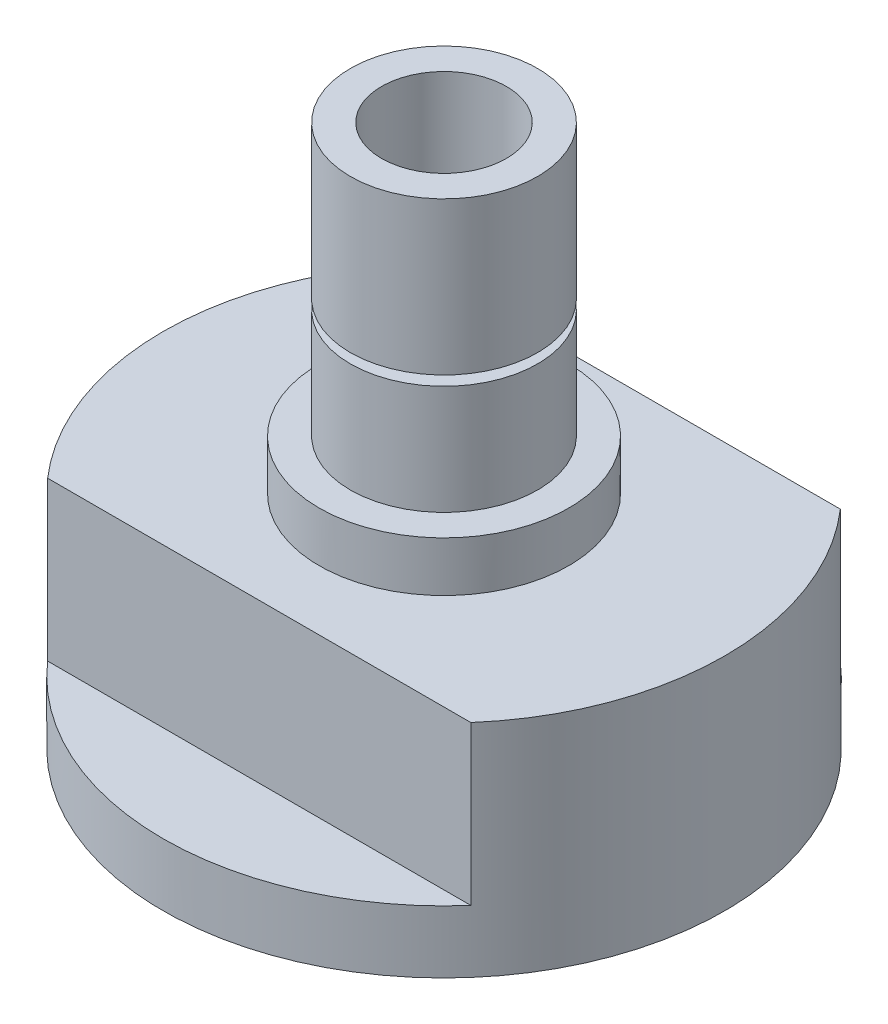
ISO-10303-21;
HEADER;
FILE_DESCRIPTION(('STEP AP214'),'2;1');
FILE_NAME('part.step','',(''),(''),'','','');
FILE_SCHEMA(('AUTOMOTIVE_DESIGN { 1 0 10303 214 1 1 1 1 }'));
ENDSEC;
DATA;
#1=APPLICATION_CONTEXT('core data for automotive mechanical design processes');
#2=APPLICATION_PROTOCOL_DEFINITION('international standard','automotive_design',2000,#1);
#3=PRODUCT_CONTEXT('',#1,'mechanical');
#4=PRODUCT('Part','Part','',(#3));
#5=PRODUCT_RELATED_PRODUCT_CATEGORY('part','',(#4));
#6=PRODUCT_DEFINITION_FORMATION('','',#4);
#7=PRODUCT_DEFINITION_CONTEXT('part definition',#1,'design');
#8=PRODUCT_DEFINITION('design','',#6,#7);
#9=PRODUCT_DEFINITION_SHAPE('','',#8);
#10=(LENGTH_UNIT() NAMED_UNIT(*) SI_UNIT(.MILLI.,.METRE.));
#11=(NAMED_UNIT(*) PLANE_ANGLE_UNIT() SI_UNIT($,.RADIAN.));
#12=(NAMED_UNIT(*) SI_UNIT($,.STERADIAN.) SOLID_ANGLE_UNIT());
#13=UNCERTAINTY_MEASURE_WITH_UNIT(LENGTH_MEASURE(1.E-05),#10,'distance_accuracy_value','');
#14=(GEOMETRIC_REPRESENTATION_CONTEXT(3) GLOBAL_UNCERTAINTY_ASSIGNED_CONTEXT((#13)) GLOBAL_UNIT_ASSIGNED_CONTEXT((#10,
#11,#12)) REPRESENTATION_CONTEXT('',''));
#15=CARTESIAN_POINT('',(0.,0.,0.));
#16=DIRECTION('',(0.,0.,1.));
#17=DIRECTION('',(1.,0.,0.));
#18=AXIS2_PLACEMENT_3D('',#15,#16,#17);
#19=CARTESIAN_POINT('',(0.,32.7025,0.));
#20=DIRECTION('',(0.,-1.,0.));
#21=DIRECTION('',(0.,0.,-1.));
#22=AXIS2_PLACEMENT_3D('',#19,#20,#21);
#23=CYLINDRICAL_SURFACE('',#22,9.525);
#24=CARTESIAN_POINT('',(0.,5.08,0.));
#25=DIRECTION('',(0.,1.,0.));
#26=DIRECTION('',(0.,0.,1.));
#27=AXIS2_PLACEMENT_3D('',#24,#25,#26);
#28=CIRCLE('',#27,9.525);
#29=CARTESIAN_POINT('',(0.,5.08,9.525));
#30=VERTEX_POINT('',#29);
#31=EDGE_CURVE('E119',#30,#30,#28,.T.);
#32=ORIENTED_EDGE('',*,*,#31,.T.);
#33=EDGE_LOOP('',(#32));
#34=FACE_BOUND('',#33,.T.);
#35=CARTESIAN_POINT('',(0.,16.1925,0.));
#36=DIRECTION('',(0.,1.,0.));
#37=DIRECTION('',(0.,0.,1.));
#38=AXIS2_PLACEMENT_3D('',#35,#36,#37);
#39=CIRCLE('',#38,9.525);
#40=CARTESIAN_POINT('',(0.,16.1925,9.525));
#41=VERTEX_POINT('',#40);
#42=EDGE_CURVE('E109',#41,#41,#39,.T.);
#43=ORIENTED_EDGE('',*,*,#42,.F.);
#44=EDGE_LOOP('',(#43));
#45=FACE_BOUND('',#44,.T.);
#46=ADVANCED_FACE('F40',(#34,#45),#23,.T.);
#47=CARTESIAN_POINT('',(0.,5.08,0.));
#48=DIRECTION('',(0.,1.,0.));
#49=DIRECTION('',(0.,0.,1.));
#50=AXIS2_PLACEMENT_3D('',#47,#48,#49);
#51=PLANE('',#50);
#52=CARTESIAN_POINT('',(0.,5.08,0.));
#53=DIRECTION('',(0.,1.,0.));
#54=DIRECTION('',(0.,0.,1.));
#55=AXIS2_PLACEMENT_3D('',#52,#53,#54);
#56=CIRCLE('',#55,12.7);
#57=CARTESIAN_POINT('',(0.,5.08,12.7));
#58=VERTEX_POINT('',#57);
#59=EDGE_CURVE('E104',#58,#58,#56,.T.);
#60=ORIENTED_EDGE('',*,*,#59,.T.);
#61=EDGE_LOOP('',(#60));
#62=FACE_BOUND('',#61,.T.);
#63=ORIENTED_EDGE('',*,*,#31,.F.);
#64=EDGE_LOOP('',(#63));
#65=FACE_BOUND('',#64,.T.);
#66=ADVANCED_FACE('F155',(#62,#65),#51,.T.);
#67=CARTESIAN_POINT('',(0.,5.08,0.));
#68=DIRECTION('',(0.,-1.,0.));
#69=DIRECTION('',(0.,0.,-1.));
#70=AXIS2_PLACEMENT_3D('',#67,#68,#69);
#71=CYLINDRICAL_SURFACE('',#70,12.7);
#72=ORIENTED_EDGE('',*,*,#59,.F.);
#73=EDGE_LOOP('',(#72));
#74=FACE_BOUND('',#73,.T.);
#75=CARTESIAN_POINT('',(0.,0.,0.));
#76=DIRECTION('',(0.,-1.,0.));
#77=DIRECTION('',(0.,0.,-1.));
#78=AXIS2_PLACEMENT_3D('',#75,#76,#77);
#79=CIRCLE('',#78,12.7);
#80=CARTESIAN_POINT('',(0.,0.,-12.7));
#81=VERTEX_POINT('',#80);
#82=EDGE_CURVE('E129',#81,#81,#79,.T.);
#83=ORIENTED_EDGE('',*,*,#82,.F.);
#84=EDGE_LOOP('',(#83));
#85=FACE_BOUND('',#84,.T.);
#86=ADVANCED_FACE('F42',(#74,#85),#71,.T.);
#87=CARTESIAN_POINT('',(0.,5.08,0.));
#88=DIRECTION('',(0.,-1.,0.));
#89=DIRECTION('',(0.,0.,-1.));
#90=AXIS2_PLACEMENT_3D('',#87,#88,#89);
#91=CYLINDRICAL_SURFACE('',#90,6.35);
#92=CARTESIAN_POINT('',(0.,0.,0.));
#93=DIRECTION('',(0.,1.,0.));
#94=DIRECTION('',(0.,0.,1.));
#95=AXIS2_PLACEMENT_3D('',#92,#93,#94);
#96=CIRCLE('',#95,6.35);
#97=CARTESIAN_POINT('',(0.,0.,6.35));
#98=VERTEX_POINT('',#97);
#99=EDGE_CURVE('E115',#98,#98,#96,.T.);
#100=ORIENTED_EDGE('',*,*,#99,.F.);
#101=EDGE_LOOP('',(#100));
#102=FACE_BOUND('',#101,.T.);
#103=CARTESIAN_POINT('',(0.,32.7025,0.));
#104=DIRECTION('',(0.,1.,0.));
#105=DIRECTION('',(0.,0.,1.));
#106=AXIS2_PLACEMENT_3D('',#103,#104,#105);
#107=CIRCLE('',#106,6.35);
#108=CARTESIAN_POINT('',(0.,32.7025,6.35));
#109=VERTEX_POINT('',#108);
#110=EDGE_CURVE('E108',#109,#109,#107,.T.);
#111=ORIENTED_EDGE('',*,*,#110,.T.);
#112=EDGE_LOOP('',(#111));
#113=FACE_BOUND('',#112,.T.);
#114=ADVANCED_FACE('F154',(#102,#113),#91,.F.);
#115=CARTESIAN_POINT('',(0.,32.7025,0.));
#116=DIRECTION('',(0.,1.,0.));
#117=DIRECTION('',(0.,0.,1.));
#118=AXIS2_PLACEMENT_3D('',#115,#116,#117);
#119=PLANE('',#118);
#120=CARTESIAN_POINT('',(0.,32.7025,0.));
#121=DIRECTION('',(0.,1.,0.));
#122=DIRECTION('',(0.,0.,1.));
#123=AXIS2_PLACEMENT_3D('',#120,#121,#122);
#124=CIRCLE('',#123,9.525);
#125=CARTESIAN_POINT('',(0.,32.7025,9.525));
#126=VERTEX_POINT('',#125);
#127=EDGE_CURVE('E118',#126,#126,#124,.T.);
#128=ORIENTED_EDGE('',*,*,#127,.T.);
#129=EDGE_LOOP('',(#128));
#130=FACE_BOUND('',#129,.T.);
#131=ORIENTED_EDGE('',*,*,#110,.F.);
#132=EDGE_LOOP('',(#131));
#133=FACE_BOUND('',#132,.T.);
#134=ADVANCED_FACE('F161',(#130,#133),#119,.T.);
#135=CARTESIAN_POINT('',(0.,17.1831,0.));
#136=DIRECTION('',(0.,1.,0.));
#137=DIRECTION('',(0.,0.,1.));
#138=AXIS2_PLACEMENT_3D('',#135,#136,#137);
#139=CIRCLE('',#138,9.525);
#140=CARTESIAN_POINT('',(0.,17.1831,9.525));
#141=VERTEX_POINT('',#140);
#142=EDGE_CURVE('E105',#141,#141,#139,.T.);
#143=ORIENTED_EDGE('',*,*,#142,.T.);
#144=EDGE_LOOP('',(#143));
#145=FACE_BOUND('',#144,.T.);
#146=ORIENTED_EDGE('',*,*,#127,.F.);
#147=EDGE_LOOP('',(#146));
#148=FACE_BOUND('',#147,.T.);
#149=ADVANCED_FACE('F169',(#145,#148),#23,.T.);
#150=CARTESIAN_POINT('',(0.,17.1831,0.));
#151=DIRECTION('',(0.,1.,0.));
#152=DIRECTION('',(0.,0.,1.));
#153=AXIS2_PLACEMENT_3D('',#150,#151,#152);
#154=PLANE('',#153);
#155=CARTESIAN_POINT('',(0.,17.1831,0.));
#156=DIRECTION('',(0.,1.,0.));
#157=DIRECTION('',(0.,0.,1.));
#158=AXIS2_PLACEMENT_3D('',#155,#156,#157);
#159=CIRCLE('',#158,7.4676);
#160=CARTESIAN_POINT('',(0.,17.1831,7.4676));
#161=VERTEX_POINT('',#160);
#162=EDGE_CURVE('E112',#161,#161,#159,.T.);
#163=ORIENTED_EDGE('',*,*,#162,.T.);
#164=EDGE_LOOP('',(#163));
#165=FACE_BOUND('',#164,.T.);
#166=ORIENTED_EDGE('',*,*,#142,.F.);
#167=EDGE_LOOP('',(#166));
#168=FACE_BOUND('',#167,.T.);
#169=ADVANCED_FACE('F175',(#165,#168),#154,.F.);
#170=CARTESIAN_POINT('',(0.,16.1925,0.));
#171=DIRECTION('',(0.,1.,0.));
#172=DIRECTION('',(0.,0.,1.));
#173=AXIS2_PLACEMENT_3D('',#170,#171,#172);
#174=PLANE('',#173);
#175=CARTESIAN_POINT('',(0.,16.1925,0.));
#176=DIRECTION('',(0.,1.,0.));
#177=DIRECTION('',(0.,0.,1.));
#178=AXIS2_PLACEMENT_3D('',#175,#176,#177);
#179=CIRCLE('',#178,7.4676);
#180=CARTESIAN_POINT('',(0.,16.1925,7.4676));
#181=VERTEX_POINT('',#180);
#182=EDGE_CURVE('E126',#181,#181,#179,.T.);
#183=ORIENTED_EDGE('',*,*,#182,.F.);
#184=EDGE_LOOP('',(#183));
#185=FACE_BOUND('',#184,.T.);
#186=ORIENTED_EDGE('',*,*,#42,.T.);
#187=EDGE_LOOP('',(#186));
#188=FACE_BOUND('',#187,.T.);
#189=ADVANCED_FACE('F181',(#185,#188),#174,.T.);
#190=CARTESIAN_POINT('',(0.,17.1831,0.));
#191=DIRECTION('',(0.,-1.,0.));
#192=DIRECTION('',(0.,0.,-1.));
#193=AXIS2_PLACEMENT_3D('',#190,#191,#192);
#194=CYLINDRICAL_SURFACE('',#193,7.4676);
#195=ORIENTED_EDGE('',*,*,#162,.F.);
#196=EDGE_LOOP('',(#195));
#197=FACE_BOUND('',#196,.T.);
#198=ORIENTED_EDGE('',*,*,#182,.T.);
#199=EDGE_LOOP('',(#198));
#200=FACE_BOUND('',#199,.T.);
#201=ADVANCED_FACE('F196',(#197,#200),#194,.T.);
#202=CARTESIAN_POINT('',(0.,0.,0.));
#203=DIRECTION('',(0.,-1.,0.));
#204=DIRECTION('',(0.,0.,-1.));
#205=AXIS2_PLACEMENT_3D('',#202,#203,#204);
#206=PLANE('',#205);
#207=ORIENTED_EDGE('',*,*,#99,.T.);
#208=EDGE_LOOP('',(#207));
#209=FACE_BOUND('',#208,.T.);
#210=ADVANCED_FACE('F149',(#209),#206,.F.);
#211=CARTESIAN_POINT('',(0.,0.,0.));
#212=DIRECTION('',(0.,-1.,0.));
#213=DIRECTION('',(0.,0.,-1.));
#214=AXIS2_PLACEMENT_3D('',#211,#212,#213);
#215=CIRCLE('',#214,28.575);
#216=CARTESIAN_POINT('',(-21.5230343817966,0.,18.796));
#217=VERTEX_POINT('',#216);
#218=CARTESIAN_POINT('',(-21.5230343817966,0.,-18.796));
#219=VERTEX_POINT('',#218);
#220=EDGE_CURVE('E136',#217,#219,#215,.T.);
#221=ORIENTED_EDGE('',*,*,#220,.F.);
#222=DIRECTION('',(-1.,0.,0.));
#223=VECTOR('',#222,1.);
#224=CARTESIAN_POINT('',(28.575,0.,18.796));
#225=LINE('',#224,#223);
#226=CARTESIAN_POINT('',(21.5230343817966,0.,18.796));
#227=VERTEX_POINT('',#226);
#228=EDGE_CURVE('E86',#227,#217,#225,.T.);
#229=ORIENTED_EDGE('',*,*,#228,.F.);
#230=CARTESIAN_POINT('',(21.5230343817966,0.,-18.796));
#231=VERTEX_POINT('',#230);
#232=EDGE_CURVE('E134',#231,#227,#215,.T.);
#233=ORIENTED_EDGE('',*,*,#232,.F.);
#234=DIRECTION('',(1.,0.,0.));
#235=VECTOR('',#234,1.);
#236=CARTESIAN_POINT('',(-28.575,0.,-18.796));
#237=LINE('',#236,#235);
#238=EDGE_CURVE('E90',#219,#231,#237,.T.);
#239=ORIENTED_EDGE('',*,*,#238,.F.);
#240=EDGE_LOOP('',(#221,#229,#233,#239));
#241=FACE_BOUND('',#240,.T.);
#242=ORIENTED_EDGE('',*,*,#82,.T.);
#243=EDGE_LOOP('',(#242));
#244=FACE_BOUND('',#243,.T.);
#245=ADVANCED_FACE('F146',(#241,#244),#206,.F.);
#246=CARTESIAN_POINT('',(0.,-6.587499906,0.));
#247=DIRECTION('',(0.,1.,0.));
#248=DIRECTION('',(0.,0.,1.));
#249=AXIS2_PLACEMENT_3D('',#246,#247,#248);
#250=CYLINDRICAL_SURFACE('',#249,28.575);
#251=CARTESIAN_POINT('',(0.,-22.462499906,0.));
#252=DIRECTION('',(0.,-1.,0.));
#253=DIRECTION('',(0.,0.,-1.));
#254=AXIS2_PLACEMENT_3D('',#251,#252,#253);
#255=CIRCLE('',#254,28.575);
#256=CARTESIAN_POINT('',(0.,-22.462499906,-28.575));
#257=VERTEX_POINT('',#256);
#258=EDGE_CURVE('E137',#257,#257,#255,.T.);
#259=ORIENTED_EDGE('',*,*,#258,.F.);
#260=EDGE_LOOP('',(#259));
#261=FACE_BOUND('',#260,.T.);
#262=DIRECTION('',(0.,1.,0.));
#263=VECTOR('',#262,1.);
#264=CARTESIAN_POINT('',(21.5230343817966,-6.587499906,18.796));
#265=LINE('',#264,#263);
#266=CARTESIAN_POINT('',(21.5230343817966,-16.112499906,18.796));
#267=VERTEX_POINT('',#266);
#268=EDGE_CURVE('E13',#227,#267,#265,.F.);
#269=ORIENTED_EDGE('',*,*,#268,.T.);
#270=CARTESIAN_POINT('',(0.,-16.112499906,0.));
#271=DIRECTION('',(0.,-1.,0.));
#272=DIRECTION('',(0.,0.,-1.));
#273=AXIS2_PLACEMENT_3D('',#270,#271,#272);
#274=CIRCLE('',#273,28.575);
#275=CARTESIAN_POINT('',(-21.5230343817966,-16.112499906,18.796));
#276=VERTEX_POINT('',#275);
#277=EDGE_CURVE('E54',#267,#276,#274,.T.);
#278=ORIENTED_EDGE('',*,*,#277,.T.);
#279=DIRECTION('',(0.,1.,0.));
#280=VECTOR('',#279,1.);
#281=CARTESIAN_POINT('',(-21.5230343817966,-6.587499906,18.796));
#282=LINE('',#281,#280);
#283=EDGE_CURVE('E48',#276,#217,#282,.T.);
#284=ORIENTED_EDGE('',*,*,#283,.T.);
#285=ORIENTED_EDGE('',*,*,#220,.T.);
#286=DIRECTION('',(0.,1.,0.));
#287=VECTOR('',#286,1.);
#288=CARTESIAN_POINT('',(-21.5230343817966,-6.587499906,-18.796));
#289=LINE('',#288,#287);
#290=CARTESIAN_POINT('',(-21.5230343817966,-16.112499906,-18.796));
#291=VERTEX_POINT('',#290);
#292=EDGE_CURVE('E97',#219,#291,#289,.F.);
#293=ORIENTED_EDGE('',*,*,#292,.T.);
#294=CARTESIAN_POINT('',(0.,-16.112499906,0.));
#295=DIRECTION('',(0.,-1.,0.));
#296=DIRECTION('',(0.,0.,-1.));
#297=AXIS2_PLACEMENT_3D('',#294,#295,#296);
#298=CIRCLE('',#297,28.575);
#299=CARTESIAN_POINT('',(21.5230343817966,-16.112499906,-18.796));
#300=VERTEX_POINT('',#299);
#301=EDGE_CURVE('E102',#291,#300,#298,.T.);
#302=ORIENTED_EDGE('',*,*,#301,.T.);
#303=DIRECTION('',(0.,1.,0.));
#304=VECTOR('',#303,1.);
#305=CARTESIAN_POINT('',(21.5230343817966,-6.587499906,-18.796));
#306=LINE('',#305,#304);
#307=EDGE_CURVE('E94',#300,#231,#306,.T.);
#308=ORIENTED_EDGE('',*,*,#307,.T.);
#309=ORIENTED_EDGE('',*,*,#232,.T.);
#310=EDGE_LOOP('',(#269,#278,#284,#285,#293,#302,#308,#309));
#311=FACE_BOUND('',#310,.T.);
#312=ADVANCED_FACE('F92',(#261,#311),#250,.T.);
#313=CARTESIAN_POINT('',(0.,-22.462499906,0.));
#314=DIRECTION('',(0.,-1.,0.));
#315=DIRECTION('',(0.,0.,-1.));
#316=AXIS2_PLACEMENT_3D('',#313,#314,#315);
#317=PLANE('',#316);
#318=ORIENTED_EDGE('',*,*,#258,.T.);
#319=EDGE_LOOP('',(#318));
#320=FACE_BOUND('',#319,.T.);
#321=ADVANCED_FACE('F203',(#320),#317,.T.);
#322=CARTESIAN_POINT('',(0.,-16.112499906,0.));
#323=DIRECTION('',(0.,-1.,0.));
#324=DIRECTION('',(0.,0.,-1.));
#325=AXIS2_PLACEMENT_3D('',#322,#323,#324);
#326=PLANE('',#325);
#327=ORIENTED_EDGE('',*,*,#301,.F.);
#328=DIRECTION('',(1.,0.,0.));
#329=VECTOR('',#328,1.);
#330=CARTESIAN_POINT('',(-28.575,-16.112499906,-18.796));
#331=LINE('',#330,#329);
#332=EDGE_CURVE('E62',#291,#300,#331,.T.);
#333=ORIENTED_EDGE('',*,*,#332,.T.);
#334=EDGE_LOOP('',(#327,#333));
#335=FACE_BOUND('',#334,.T.);
#336=ADVANCED_FACE('F210',(#335),#326,.F.);
#337=CARTESIAN_POINT('',(-28.575,-80.443111674073,-18.796));
#338=DIRECTION('',(0.,0.,1.));
#339=DIRECTION('',(1.,0.,0.));
#340=AXIS2_PLACEMENT_3D('',#337,#338,#339);
#341=PLANE('',#340);
#342=ORIENTED_EDGE('',*,*,#332,.F.);
#343=ORIENTED_EDGE('',*,*,#292,.F.);
#344=ORIENTED_EDGE('',*,*,#238,.T.);
#345=ORIENTED_EDGE('',*,*,#307,.F.);
#346=EDGE_LOOP('',(#342,#343,#344,#345));
#347=FACE_BOUND('',#346,.T.);
#348=ADVANCED_FACE('F143',(#347),#341,.F.);
#349=CARTESIAN_POINT('',(0.,-16.112499906,0.));
#350=DIRECTION('',(0.,-1.,0.));
#351=DIRECTION('',(0.,0.,-1.));
#352=AXIS2_PLACEMENT_3D('',#349,#350,#351);
#353=PLANE('',#352);
#354=DIRECTION('',(-1.,0.,0.));
#355=VECTOR('',#354,1.);
#356=CARTESIAN_POINT('',(28.575,-16.112499906,18.796));
#357=LINE('',#356,#355);
#358=EDGE_CURVE('E84',#267,#276,#357,.T.);
#359=ORIENTED_EDGE('',*,*,#358,.T.);
#360=ORIENTED_EDGE('',*,*,#277,.F.);
#361=EDGE_LOOP('',(#359,#360));
#362=FACE_BOUND('',#361,.T.);
#363=ADVANCED_FACE('F89',(#362),#353,.F.);
#364=CARTESIAN_POINT('',(28.575,-80.443111674073,18.796));
#365=DIRECTION('',(0.,0.,-1.));
#366=DIRECTION('',(-1.,0.,0.));
#367=AXIS2_PLACEMENT_3D('',#364,#365,#366);
#368=PLANE('',#367);
#369=ORIENTED_EDGE('',*,*,#358,.F.);
#370=ORIENTED_EDGE('',*,*,#268,.F.);
#371=ORIENTED_EDGE('',*,*,#228,.T.);
#372=ORIENTED_EDGE('',*,*,#283,.F.);
#373=EDGE_LOOP('',(#369,#370,#371,#372));
#374=FACE_BOUND('',#373,.T.);
#375=ADVANCED_FACE('F83',(#374),#368,.F.);
#376=CLOSED_SHELL('',(#46,#66,#86,#114,#134,#149,#169,#189,#201,#210,#245,#312,#321,#336,#348,
#363,#375));
#377=MANIFOLD_SOLID_BREP('B2',#376);
#378=ADVANCED_BREP_SHAPE_REPRESENTATION('',(#18,#377),#14);
#379=SHAPE_DEFINITION_REPRESENTATION(#9,#378);
ENDSEC;
END-ISO-10303-21;
